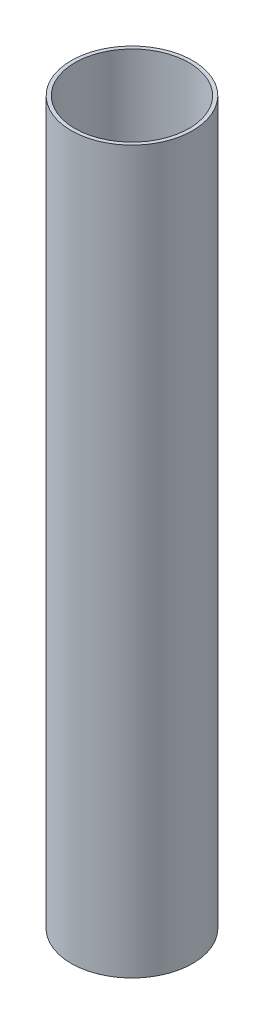
ISO-10303-21;
HEADER;
FILE_DESCRIPTION(('STEP AP214'),'2;1');
FILE_NAME('part.step','',(''),(''),'','','');
FILE_SCHEMA(('AUTOMOTIVE_DESIGN { 1 0 10303 214 1 1 1 1 }'));
ENDSEC;
DATA;
#1=APPLICATION_CONTEXT('core data for automotive mechanical design processes');
#2=APPLICATION_PROTOCOL_DEFINITION('international standard','automotive_design',2000,#1);
#3=PRODUCT_CONTEXT('',#1,'mechanical');
#4=PRODUCT('Part','Part','',(#3));
#5=PRODUCT_RELATED_PRODUCT_CATEGORY('part','',(#4));
#6=PRODUCT_DEFINITION_FORMATION('','',#4);
#7=PRODUCT_DEFINITION_CONTEXT('part definition',#1,'design');
#8=PRODUCT_DEFINITION('design','',#6,#7);
#9=PRODUCT_DEFINITION_SHAPE('','',#8);
#10=(LENGTH_UNIT() NAMED_UNIT(*) SI_UNIT(.MILLI.,.METRE.));
#11=(NAMED_UNIT(*) PLANE_ANGLE_UNIT() SI_UNIT($,.RADIAN.));
#12=(NAMED_UNIT(*) SI_UNIT($,.STERADIAN.) SOLID_ANGLE_UNIT());
#13=UNCERTAINTY_MEASURE_WITH_UNIT(LENGTH_MEASURE(1.E-05),#10,'distance_accuracy_value','');
#14=(GEOMETRIC_REPRESENTATION_CONTEXT(3) GLOBAL_UNCERTAINTY_ASSIGNED_CONTEXT((#13)) GLOBAL_UNIT_ASSIGNED_CONTEXT((#10,
#11,#12)) REPRESENTATION_CONTEXT('',''));
#15=CARTESIAN_POINT('',(0.,0.,0.));
#16=DIRECTION('',(0.,0.,1.));
#17=DIRECTION('',(1.,0.,0.));
#18=AXIS2_PLACEMENT_3D('',#15,#16,#17);
#19=CARTESIAN_POINT('',(0.,297.,0.));
#20=DIRECTION('',(0.,1.,0.));
#21=DIRECTION('',(0.,0.,1.));
#22=AXIS2_PLACEMENT_3D('',#19,#20,#21);
#23=PLANE('',#22);
#24=CARTESIAN_POINT('',(0.,297.,0.));
#25=DIRECTION('',(0.,1.,0.));
#26=DIRECTION('',(0.,0.,1.));
#27=AXIS2_PLACEMENT_3D('',#24,#25,#26);
#28=CIRCLE('',#27,25.);
#29=CARTESIAN_POINT('',(0.,297.,25.));
#30=VERTEX_POINT('',#29);
#31=EDGE_CURVE('E10',#30,#30,#28,.T.);
#32=ORIENTED_EDGE('',*,*,#31,.T.);
#33=EDGE_LOOP('',(#32));
#34=FACE_BOUND('',#33,.T.);
#35=CARTESIAN_POINT('',(0.,297.,0.));
#36=DIRECTION('',(0.,1.,0.));
#37=DIRECTION('',(0.,0.,1.));
#38=AXIS2_PLACEMENT_3D('',#35,#36,#37);
#39=CIRCLE('',#38,23.5);
#40=CARTESIAN_POINT('',(0.,297.,23.5));
#41=VERTEX_POINT('',#40);
#42=EDGE_CURVE('E53',#41,#41,#39,.T.);
#43=ORIENTED_EDGE('',*,*,#42,.F.);
#44=EDGE_LOOP('',(#43));
#45=FACE_BOUND('',#44,.T.);
#46=ADVANCED_FACE('F42',(#34,#45),#23,.T.);
#47=CARTESIAN_POINT('',(0.,0.,0.));
#48=DIRECTION('',(0.,1.,0.));
#49=DIRECTION('',(0.,0.,1.));
#50=AXIS2_PLACEMENT_3D('',#47,#48,#49);
#51=PLANE('',#50);
#52=CARTESIAN_POINT('',(0.,0.,0.));
#53=DIRECTION('',(0.,1.,0.));
#54=DIRECTION('',(0.,0.,1.));
#55=AXIS2_PLACEMENT_3D('',#52,#53,#54);
#56=CIRCLE('',#55,25.);
#57=CARTESIAN_POINT('',(0.,0.,25.));
#58=VERTEX_POINT('',#57);
#59=EDGE_CURVE('E46',#58,#58,#56,.T.);
#60=ORIENTED_EDGE('',*,*,#59,.F.);
#61=EDGE_LOOP('',(#60));
#62=FACE_BOUND('',#61,.T.);
#63=CARTESIAN_POINT('',(0.,0.,0.));
#64=DIRECTION('',(0.,1.,0.));
#65=DIRECTION('',(0.,0.,1.));
#66=AXIS2_PLACEMENT_3D('',#63,#64,#65);
#67=CIRCLE('',#66,23.5);
#68=CARTESIAN_POINT('',(0.,0.,23.5));
#69=VERTEX_POINT('',#68);
#70=EDGE_CURVE('E55',#69,#69,#67,.T.);
#71=ORIENTED_EDGE('',*,*,#70,.T.);
#72=EDGE_LOOP('',(#71));
#73=FACE_BOUND('',#72,.T.);
#74=ADVANCED_FACE('F65',(#62,#73),#51,.F.);
#75=CARTESIAN_POINT('',(0.,297.,0.));
#76=DIRECTION('',(0.,-1.,0.));
#77=DIRECTION('',(0.,0.,-1.));
#78=AXIS2_PLACEMENT_3D('',#75,#76,#77);
#79=CYLINDRICAL_SURFACE('',#78,25.);
#80=ORIENTED_EDGE('',*,*,#31,.F.);
#81=EDGE_LOOP('',(#80));
#82=FACE_BOUND('',#81,.T.);
#83=ORIENTED_EDGE('',*,*,#59,.T.);
#84=EDGE_LOOP('',(#83));
#85=FACE_BOUND('',#84,.T.);
#86=ADVANCED_FACE('F44',(#82,#85),#79,.T.);
#87=CARTESIAN_POINT('',(0.,297.,0.));
#88=DIRECTION('',(0.,-1.,0.));
#89=DIRECTION('',(0.,0.,-1.));
#90=AXIS2_PLACEMENT_3D('',#87,#88,#89);
#91=CYLINDRICAL_SURFACE('',#90,23.5);
#92=ORIENTED_EDGE('',*,*,#42,.T.);
#93=EDGE_LOOP('',(#92));
#94=FACE_BOUND('',#93,.T.);
#95=ORIENTED_EDGE('',*,*,#70,.F.);
#96=EDGE_LOOP('',(#95));
#97=FACE_BOUND('',#96,.T.);
#98=ADVANCED_FACE('F61',(#94,#97),#91,.F.);
#99=CLOSED_SHELL('',(#46,#74,#86,#98));
#100=MANIFOLD_SOLID_BREP('B2',#99);
#101=ADVANCED_BREP_SHAPE_REPRESENTATION('',(#18,#100),#14);
#102=SHAPE_DEFINITION_REPRESENTATION(#9,#101);
ENDSEC;
END-ISO-10303-21;
